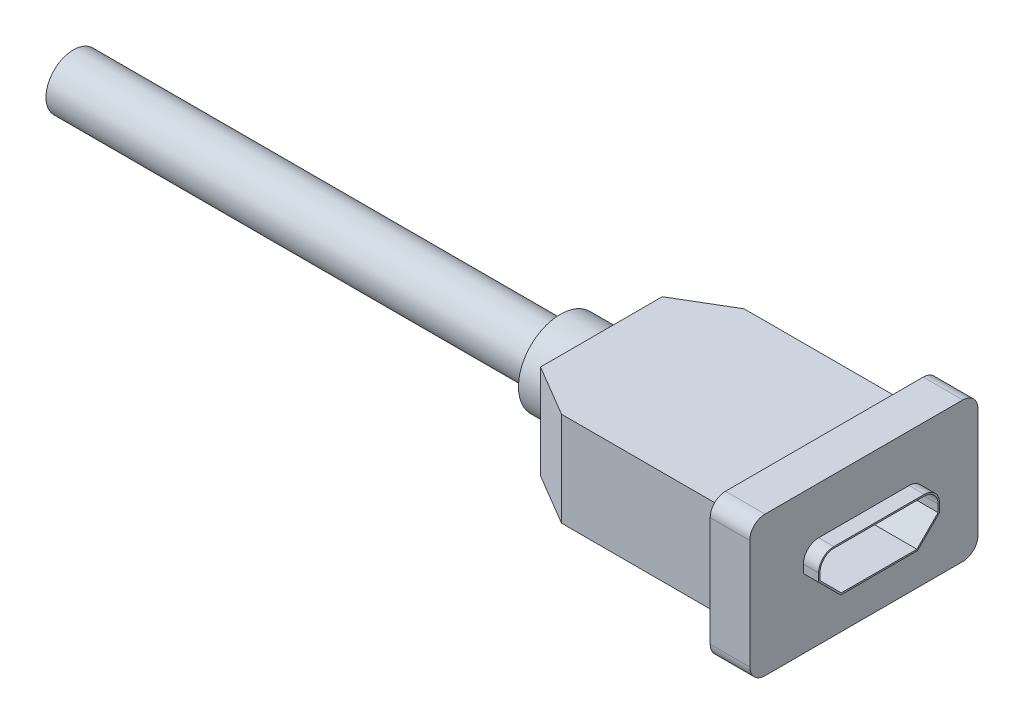
ISO-10303-21;
HEADER;
FILE_DESCRIPTION(('STEP AP214'),'2;1');
FILE_NAME('part.step','',(''),(''),'','','');
FILE_SCHEMA(('AUTOMOTIVE_DESIGN { 1 0 10303 214 1 1 1 1 }'));
ENDSEC;
DATA;
#1=APPLICATION_CONTEXT('core data for automotive mechanical design processes');
#2=APPLICATION_PROTOCOL_DEFINITION('international standard','automotive_design',2000,#1);
#3=PRODUCT_CONTEXT('',#1,'mechanical');
#4=PRODUCT('Part','Part','',(#3));
#5=PRODUCT_RELATED_PRODUCT_CATEGORY('part','',(#4));
#6=PRODUCT_DEFINITION_FORMATION('','',#4);
#7=PRODUCT_DEFINITION_CONTEXT('part definition',#1,'design');
#8=PRODUCT_DEFINITION('design','',#6,#7);
#9=PRODUCT_DEFINITION_SHAPE('','',#8);
#10=(LENGTH_UNIT() NAMED_UNIT(*) SI_UNIT(.MILLI.,.METRE.));
#11=(NAMED_UNIT(*) PLANE_ANGLE_UNIT() SI_UNIT($,.RADIAN.));
#12=(NAMED_UNIT(*) SI_UNIT($,.STERADIAN.) SOLID_ANGLE_UNIT());
#13=UNCERTAINTY_MEASURE_WITH_UNIT(LENGTH_MEASURE(1.E-05),#10,'distance_accuracy_value','');
#14=(GEOMETRIC_REPRESENTATION_CONTEXT(3) GLOBAL_UNCERTAINTY_ASSIGNED_CONTEXT((#13)) GLOBAL_UNIT_ASSIGNED_CONTEXT((#10,
#11,#12)) REPRESENTATION_CONTEXT('',''));
#15=CARTESIAN_POINT('',(0.,0.,0.));
#16=DIRECTION('',(0.,0.,1.));
#17=DIRECTION('',(1.,0.,0.));
#18=AXIS2_PLACEMENT_3D('',#15,#16,#17);
#19=CARTESIAN_POINT('',(0.,3.1,-6.));
#20=DIRECTION('',(-1.,0.,0.));
#21=DIRECTION('',(0.,0.,1.));
#22=AXIS2_PLACEMENT_3D('',#19,#20,#21);
#23=PLANE('',#22);
#24=DIRECTION('',(0.,0.,1.));
#25=VECTOR('',#24,1.);
#26=CARTESIAN_POINT('',(0.,4.6,-7.5));
#27=LINE('',#26,#25);
#28=CARTESIAN_POINT('',(0.,4.6,-6.5));
#29=VERTEX_POINT('',#28);
#30=CARTESIAN_POINT('',(0.,4.6,6.5));
#31=VERTEX_POINT('',#30);
#32=EDGE_CURVE('E381',#29,#31,#27,.T.);
#33=ORIENTED_EDGE('',*,*,#32,.T.);
#34=CARTESIAN_POINT('',(0.,3.6,6.5));
#35=DIRECTION('',(-1.,0.,0.));
#36=DIRECTION('',(0.,0.,1.));
#37=AXIS2_PLACEMENT_3D('',#34,#35,#36);
#38=CIRCLE('',#37,1.);
#39=CARTESIAN_POINT('',(0.,3.6,7.5));
#40=VERTEX_POINT('',#39);
#41=EDGE_CURVE('E452',#31,#40,#38,.F.);
#42=ORIENTED_EDGE('',*,*,#41,.T.);
#43=DIRECTION('',(0.,-1.,0.));
#44=VECTOR('',#43,1.);
#45=CARTESIAN_POINT('',(0.,4.6,7.5));
#46=LINE('',#45,#44);
#47=CARTESIAN_POINT('',(0.,-3.6,7.5));
#48=VERTEX_POINT('',#47);
#49=EDGE_CURVE('E373',#40,#48,#46,.T.);
#50=ORIENTED_EDGE('',*,*,#49,.T.);
#51=CARTESIAN_POINT('',(0.,-3.6,6.5));
#52=DIRECTION('',(-1.,0.,0.));
#53=DIRECTION('',(0.,0.,1.));
#54=AXIS2_PLACEMENT_3D('',#51,#52,#53);
#55=CIRCLE('',#54,1.);
#56=CARTESIAN_POINT('',(0.,-4.6,6.5));
#57=VERTEX_POINT('',#56);
#58=EDGE_CURVE('E450',#48,#57,#55,.F.);
#59=ORIENTED_EDGE('',*,*,#58,.T.);
#60=DIRECTION('',(0.,0.,-1.));
#61=VECTOR('',#60,1.);
#62=CARTESIAN_POINT('',(0.,-4.6,7.5));
#63=LINE('',#62,#61);
#64=CARTESIAN_POINT('',(0.,-4.6,-6.5));
#65=VERTEX_POINT('',#64);
#66=EDGE_CURVE('E393',#57,#65,#63,.T.);
#67=ORIENTED_EDGE('',*,*,#66,.T.);
#68=CARTESIAN_POINT('',(0.,-3.6,-6.5));
#69=DIRECTION('',(-1.,0.,0.));
#70=DIRECTION('',(0.,0.,1.));
#71=AXIS2_PLACEMENT_3D('',#68,#69,#70);
#72=CIRCLE('',#71,1.);
#73=CARTESIAN_POINT('',(0.,-3.6,-7.5));
#74=VERTEX_POINT('',#73);
#75=EDGE_CURVE('E448',#65,#74,#72,.F.);
#76=ORIENTED_EDGE('',*,*,#75,.T.);
#77=DIRECTION('',(0.,1.,0.));
#78=VECTOR('',#77,1.);
#79=CARTESIAN_POINT('',(0.,-4.6,-7.5));
#80=LINE('',#79,#78);
#81=CARTESIAN_POINT('',(0.,3.6,-7.5));
#82=VERTEX_POINT('',#81);
#83=EDGE_CURVE('E396',#74,#82,#80,.T.);
#84=ORIENTED_EDGE('',*,*,#83,.T.);
#85=CARTESIAN_POINT('',(0.,3.6,-6.5));
#86=DIRECTION('',(-1.,0.,0.));
#87=DIRECTION('',(0.,0.,1.));
#88=AXIS2_PLACEMENT_3D('',#85,#86,#87);
#89=CIRCLE('',#88,1.);
#90=EDGE_CURVE('E446',#82,#29,#89,.F.);
#91=ORIENTED_EDGE('',*,*,#90,.T.);
#92=EDGE_LOOP('',(#33,#42,#50,#59,#67,#76,#84,#91));
#93=FACE_BOUND('',#92,.T.);
#94=CARTESIAN_POINT('',(0.,0.489999999999999,-2.975));
#95=DIRECTION('',(1.,0.,0.));
#96=DIRECTION('',(0.,0.,-1.));
#97=AXIS2_PLACEMENT_3D('',#94,#95,#96);
#98=CIRCLE('',#97,1.);
#99=CARTESIAN_POINT('',(0.,0.49,-3.975));
#100=VERTEX_POINT('',#99);
#101=CARTESIAN_POINT('',(0.,1.49,-2.975));
#102=VERTEX_POINT('',#101);
#103=EDGE_CURVE('E270',#100,#102,#98,.T.);
#104=ORIENTED_EDGE('',*,*,#103,.F.);
#105=DIRECTION('',(0.,1.,0.));
#106=VECTOR('',#105,1.);
#107=CARTESIAN_POINT('',(0.,-0.0414213562373096,-3.975));
#108=LINE('',#107,#106);
#109=CARTESIAN_POINT('',(0.,-0.0414213562373094,-3.975));
#110=VERTEX_POINT('',#109);
#111=EDGE_CURVE('E275',#110,#100,#108,.T.);
#112=ORIENTED_EDGE('',*,*,#111,.F.);
#113=DIRECTION('',(0.,0.707106781186551,-0.707106781186544));
#114=VECTOR('',#113,1.);
#115=CARTESIAN_POINT('',(0.,-1.49,-2.52642135623732));
#116=LINE('',#115,#114);
#117=CARTESIAN_POINT('',(0.,-1.49,-2.52642135623733));
#118=VERTEX_POINT('',#117);
#119=EDGE_CURVE('E303',#118,#110,#116,.T.);
#120=ORIENTED_EDGE('',*,*,#119,.F.);
#121=DIRECTION('',(0.,0.,-1.));
#122=VECTOR('',#121,1.);
#123=CARTESIAN_POINT('',(0.,-1.49,2.52642135623732));
#124=LINE('',#123,#122);
#125=CARTESIAN_POINT('',(0.,-1.49,2.52642135623732));
#126=VERTEX_POINT('',#125);
#127=EDGE_CURVE('E300',#126,#118,#124,.T.);
#128=ORIENTED_EDGE('',*,*,#127,.F.);
#129=DIRECTION('',(0.,-0.707106781186551,-0.707106781186544));
#130=VECTOR('',#129,1.);
#131=CARTESIAN_POINT('',(0.,-0.0414213562373089,3.975));
#132=LINE('',#131,#130);
#133=CARTESIAN_POINT('',(0.,-0.0414213562373099,3.975));
#134=VERTEX_POINT('',#133);
#135=EDGE_CURVE('E297',#134,#126,#132,.T.);
#136=ORIENTED_EDGE('',*,*,#135,.F.);
#137=DIRECTION('',(0.,-1.,0.));
#138=VECTOR('',#137,1.);
#139=CARTESIAN_POINT('',(0.,0.49,3.975));
#140=LINE('',#139,#138);
#141=CARTESIAN_POINT('',(0.,0.49,3.975));
#142=VERTEX_POINT('',#141);
#143=EDGE_CURVE('E294',#142,#134,#140,.T.);
#144=ORIENTED_EDGE('',*,*,#143,.F.);
#145=CARTESIAN_POINT('',(0.,0.489999999999999,2.975));
#146=DIRECTION('',(1.,0.,0.));
#147=DIRECTION('',(0.,0.,-1.));
#148=AXIS2_PLACEMENT_3D('',#145,#146,#147);
#149=CIRCLE('',#148,1.);
#150=CARTESIAN_POINT('',(0.,1.49,2.975));
#151=VERTEX_POINT('',#150);
#152=EDGE_CURVE('E53',#151,#142,#149,.T.);
#153=ORIENTED_EDGE('',*,*,#152,.F.);
#154=DIRECTION('',(0.,0.,1.));
#155=VECTOR('',#154,1.);
#156=CARTESIAN_POINT('',(0.,1.49,-2.975));
#157=LINE('',#156,#155);
#158=EDGE_CURVE('E48',#102,#151,#157,.T.);
#159=ORIENTED_EDGE('',*,*,#158,.F.);
#160=EDGE_LOOP('',(#104,#112,#120,#128,#136,#144,#153,#159));
#161=FACE_BOUND('',#160,.T.);
#162=ADVANCED_FACE('F33',(#93,#161),#23,.F.);
#163=CARTESIAN_POINT('',(-13.87,3.1,-6.));
#164=DIRECTION('',(0.,0.,1.));
#165=DIRECTION('',(1.,0.,0.));
#166=AXIS2_PLACEMENT_3D('',#163,#164,#165);
#167=PLANE('',#166);
#168=DIRECTION('',(0.,1.,0.));
#169=VECTOR('',#168,1.);
#170=CARTESIAN_POINT('',(-2.6,3.1,-6.));
#171=LINE('',#170,#169);
#172=CARTESIAN_POINT('',(-2.6,-3.1,-6.));
#173=VERTEX_POINT('',#172);
#174=CARTESIAN_POINT('',(-2.6,3.1,-6.));
#175=VERTEX_POINT('',#174);
#176=EDGE_CURVE('E402',#173,#175,#171,.T.);
#177=ORIENTED_EDGE('',*,*,#176,.F.);
#178=DIRECTION('',(-1.,0.,0.));
#179=VECTOR('',#178,1.);
#180=CARTESIAN_POINT('',(-13.87,-3.1,-6.));
#181=LINE('',#180,#179);
#182=CARTESIAN_POINT('',(-13.87,-3.1,-6.));
#183=VERTEX_POINT('',#182);
#184=EDGE_CURVE('E406',#173,#183,#181,.T.);
#185=ORIENTED_EDGE('',*,*,#184,.T.);
#186=DIRECTION('',(0.,-1.,0.));
#187=VECTOR('',#186,1.);
#188=CARTESIAN_POINT('',(-13.87,3.1,-6.));
#189=LINE('',#188,#187);
#190=CARTESIAN_POINT('',(-13.87,3.1,-6.));
#191=VERTEX_POINT('',#190);
#192=EDGE_CURVE('E437',#191,#183,#189,.T.);
#193=ORIENTED_EDGE('',*,*,#192,.F.);
#194=DIRECTION('',(-1.,0.,0.));
#195=VECTOR('',#194,1.);
#196=CARTESIAN_POINT('',(-13.87,3.1,-6.));
#197=LINE('',#196,#195);
#198=EDGE_CURVE('E407',#175,#191,#197,.T.);
#199=ORIENTED_EDGE('',*,*,#198,.F.);
#200=EDGE_LOOP('',(#177,#185,#193,#199));
#201=FACE_BOUND('',#200,.T.);
#202=ADVANCED_FACE('F520',(#201),#167,.F.);
#203=CARTESIAN_POINT('',(0.,3.1,6.));
#204=DIRECTION('',(0.,0.,-1.));
#205=DIRECTION('',(-1.,0.,0.));
#206=AXIS2_PLACEMENT_3D('',#203,#204,#205);
#207=PLANE('',#206);
#208=DIRECTION('',(0.,-1.,0.));
#209=VECTOR('',#208,1.);
#210=CARTESIAN_POINT('',(-2.6,3.1,6.));
#211=LINE('',#210,#209);
#212=CARTESIAN_POINT('',(-2.6,3.1,6.));
#213=VERTEX_POINT('',#212);
#214=CARTESIAN_POINT('',(-2.6,-3.1,6.));
#215=VERTEX_POINT('',#214);
#216=EDGE_CURVE('E390',#213,#215,#211,.T.);
#217=ORIENTED_EDGE('',*,*,#216,.F.);
#218=DIRECTION('',(1.,0.,0.));
#219=VECTOR('',#218,1.);
#220=CARTESIAN_POINT('',(0.,3.1,6.));
#221=LINE('',#220,#219);
#222=CARTESIAN_POINT('',(-13.87,3.1,6.));
#223=VERTEX_POINT('',#222);
#224=EDGE_CURVE('E416',#223,#213,#221,.T.);
#225=ORIENTED_EDGE('',*,*,#224,.F.);
#226=DIRECTION('',(0.,-1.,0.));
#227=VECTOR('',#226,1.);
#228=CARTESIAN_POINT('',(-13.87,3.1,6.));
#229=LINE('',#228,#227);
#230=CARTESIAN_POINT('',(-13.87,-3.1,6.));
#231=VERTEX_POINT('',#230);
#232=EDGE_CURVE('E419',#223,#231,#229,.T.);
#233=ORIENTED_EDGE('',*,*,#232,.T.);
#234=DIRECTION('',(1.,0.,0.));
#235=VECTOR('',#234,1.);
#236=CARTESIAN_POINT('',(0.,-3.1,6.));
#237=LINE('',#236,#235);
#238=EDGE_CURVE('E410',#231,#215,#237,.T.);
#239=ORIENTED_EDGE('',*,*,#238,.T.);
#240=EDGE_LOOP('',(#217,#225,#233,#239));
#241=FACE_BOUND('',#240,.T.);
#242=ADVANCED_FACE('F525',(#241),#207,.F.);
#243=CARTESIAN_POINT('',(0.,3.1,0.));
#244=DIRECTION('',(0.,-1.,0.));
#245=DIRECTION('',(0.,0.,-1.));
#246=AXIS2_PLACEMENT_3D('',#243,#244,#245);
#247=PLANE('',#246);
#248=DIRECTION('',(0.,0.,1.));
#249=VECTOR('',#248,1.);
#250=CARTESIAN_POINT('',(-2.6,3.1,0.));
#251=LINE('',#250,#249);
#252=EDGE_CURVE('E404',#175,#213,#251,.T.);
#253=ORIENTED_EDGE('',*,*,#252,.F.);
#254=ORIENTED_EDGE('',*,*,#198,.T.);
#255=DIRECTION('',(-0.860622231738049,0.,0.509243924105354));
#256=VECTOR('',#255,1.);
#257=CARTESIAN_POINT('',(-17.25,3.1,-4.));
#258=LINE('',#257,#256);
#259=CARTESIAN_POINT('',(-17.25,3.1,-4.));
#260=VERTEX_POINT('',#259);
#261=EDGE_CURVE('E409',#191,#260,#258,.T.);
#262=ORIENTED_EDGE('',*,*,#261,.T.);
#263=DIRECTION('',(0.,0.,1.));
#264=VECTOR('',#263,1.);
#265=CARTESIAN_POINT('',(-17.25,3.1,4.));
#266=LINE('',#265,#264);
#267=CARTESIAN_POINT('',(-17.25,3.1,4.));
#268=VERTEX_POINT('',#267);
#269=EDGE_CURVE('E412',#260,#268,#266,.T.);
#270=ORIENTED_EDGE('',*,*,#269,.T.);
#271=DIRECTION('',(0.860622231738049,0.,0.509243924105354));
#272=VECTOR('',#271,1.);
#273=CARTESIAN_POINT('',(-13.87,3.1,6.));
#274=LINE('',#273,#272);
#275=EDGE_CURVE('E414',#268,#223,#274,.T.);
#276=ORIENTED_EDGE('',*,*,#275,.T.);
#277=ORIENTED_EDGE('',*,*,#224,.T.);
#278=EDGE_LOOP('',(#253,#254,#262,#270,#276,#277));
#279=FACE_BOUND('',#278,.T.);
#280=ADVANCED_FACE('F534',(#279),#247,.F.);
#281=CARTESIAN_POINT('',(0.,-3.1,0.));
#282=DIRECTION('',(0.,-1.,0.));
#283=DIRECTION('',(0.,0.,-1.));
#284=AXIS2_PLACEMENT_3D('',#281,#282,#283);
#285=PLANE('',#284);
#286=ORIENTED_EDGE('',*,*,#184,.F.);
#287=DIRECTION('',(0.,0.,1.));
#288=VECTOR('',#287,1.);
#289=CARTESIAN_POINT('',(-2.6,-3.1,0.));
#290=LINE('',#289,#288);
#291=EDGE_CURVE('E376',#173,#215,#290,.T.);
#292=ORIENTED_EDGE('',*,*,#291,.T.);
#293=ORIENTED_EDGE('',*,*,#238,.F.);
#294=DIRECTION('',(0.860622231738049,0.,0.509243924105354));
#295=VECTOR('',#294,1.);
#296=CARTESIAN_POINT('',(-13.87,-3.1,6.));
#297=LINE('',#296,#295);
#298=CARTESIAN_POINT('',(-17.25,-3.1,4.));
#299=VERTEX_POINT('',#298);
#300=EDGE_CURVE('E425',#299,#231,#297,.T.);
#301=ORIENTED_EDGE('',*,*,#300,.F.);
#302=DIRECTION('',(0.,0.,1.));
#303=VECTOR('',#302,1.);
#304=CARTESIAN_POINT('',(-17.25,-3.1,4.));
#305=LINE('',#304,#303);
#306=CARTESIAN_POINT('',(-17.25,-3.1,-4.));
#307=VERTEX_POINT('',#306);
#308=EDGE_CURVE('E423',#307,#299,#305,.T.);
#309=ORIENTED_EDGE('',*,*,#308,.F.);
#310=DIRECTION('',(-0.860622231738049,0.,0.509243924105354));
#311=VECTOR('',#310,1.);
#312=CARTESIAN_POINT('',(-17.25,-3.1,-4.));
#313=LINE('',#312,#311);
#314=EDGE_CURVE('E421',#183,#307,#313,.T.);
#315=ORIENTED_EDGE('',*,*,#314,.F.);
#316=EDGE_LOOP('',(#286,#292,#293,#301,#309,#315));
#317=FACE_BOUND('',#316,.T.);
#318=ADVANCED_FACE('F530',(#317),#285,.T.);
#319=CARTESIAN_POINT('',(-17.25,3.1,-4.));
#320=DIRECTION('',(0.509243924105354,0.,0.860622231738049));
#321=DIRECTION('',(0.860622231738049,0.,-0.509243924105354));
#322=AXIS2_PLACEMENT_3D('',#319,#320,#321);
#323=PLANE('',#322);
#324=ORIENTED_EDGE('',*,*,#314,.T.);
#325=DIRECTION('',(0.,-1.,0.));
#326=VECTOR('',#325,1.);
#327=CARTESIAN_POINT('',(-17.25,3.1,-4.));
#328=LINE('',#327,#326);
#329=EDGE_CURVE('E434',#260,#307,#328,.T.);
#330=ORIENTED_EDGE('',*,*,#329,.F.);
#331=ORIENTED_EDGE('',*,*,#261,.F.);
#332=ORIENTED_EDGE('',*,*,#192,.T.);
#333=EDGE_LOOP('',(#324,#330,#331,#332));
#334=FACE_BOUND('',#333,.T.);
#335=ADVANCED_FACE('F543',(#334),#323,.F.);
#336=CARTESIAN_POINT('',(-17.25,3.1,4.));
#337=DIRECTION('',(1.,0.,0.));
#338=DIRECTION('',(0.,0.,-1.));
#339=AXIS2_PLACEMENT_3D('',#336,#337,#338);
#340=PLANE('',#339);
#341=CARTESIAN_POINT('',(-17.25,0.,0.));
#342=DIRECTION('',(-1.,0.,0.));
#343=DIRECTION('',(0.,0.,1.));
#344=AXIS2_PLACEMENT_3D('',#341,#342,#343);
#345=CIRCLE('',#344,2.75);
#346=CARTESIAN_POINT('',(-17.25,0.,2.75));
#347=VERTEX_POINT('',#346);
#348=EDGE_CURVE('E370',#347,#347,#345,.T.);
#349=ORIENTED_EDGE('',*,*,#348,.F.);
#350=EDGE_LOOP('',(#349));
#351=FACE_BOUND('',#350,.T.);
#352=ORIENTED_EDGE('',*,*,#308,.T.);
#353=DIRECTION('',(0.,-1.,0.));
#354=VECTOR('',#353,1.);
#355=CARTESIAN_POINT('',(-17.25,3.1,4.));
#356=LINE('',#355,#354);
#357=EDGE_CURVE('E431',#268,#299,#356,.T.);
#358=ORIENTED_EDGE('',*,*,#357,.F.);
#359=ORIENTED_EDGE('',*,*,#269,.F.);
#360=ORIENTED_EDGE('',*,*,#329,.T.);
#361=EDGE_LOOP('',(#352,#358,#359,#360));
#362=FACE_BOUND('',#361,.T.);
#363=ADVANCED_FACE('F539',(#351,#362),#340,.F.);
#364=CARTESIAN_POINT('',(-13.87,3.1,6.));
#365=DIRECTION('',(0.509243924105354,0.,-0.860622231738049));
#366=DIRECTION('',(-0.860622231738049,0.,-0.509243924105354));
#367=AXIS2_PLACEMENT_3D('',#364,#365,#366);
#368=PLANE('',#367);
#369=ORIENTED_EDGE('',*,*,#300,.T.);
#370=ORIENTED_EDGE('',*,*,#232,.F.);
#371=ORIENTED_EDGE('',*,*,#275,.F.);
#372=ORIENTED_EDGE('',*,*,#357,.T.);
#373=EDGE_LOOP('',(#369,#370,#371,#372));
#374=FACE_BOUND('',#373,.T.);
#375=ADVANCED_FACE('F536',(#374),#368,.F.);
#376=CARTESIAN_POINT('',(-2.6,0.,0.));
#377=DIRECTION('',(1.,0.,0.));
#378=DIRECTION('',(0.,0.,-1.));
#379=AXIS2_PLACEMENT_3D('',#376,#377,#378);
#380=PLANE('',#379);
#381=DIRECTION('',(0.,-1.,0.));
#382=VECTOR('',#381,1.);
#383=CARTESIAN_POINT('',(-2.6,4.6,7.5));
#384=LINE('',#383,#382);
#385=CARTESIAN_POINT('',(-2.6,3.6,7.5));
#386=VERTEX_POINT('',#385);
#387=CARTESIAN_POINT('',(-2.6,-3.6,7.5));
#388=VERTEX_POINT('',#387);
#389=EDGE_CURVE('E377',#386,#388,#384,.T.);
#390=ORIENTED_EDGE('',*,*,#389,.F.);
#391=CARTESIAN_POINT('',(-2.6,3.6,6.5));
#392=DIRECTION('',(1.,0.,0.));
#393=DIRECTION('',(0.,0.,-1.));
#394=AXIS2_PLACEMENT_3D('',#391,#392,#393);
#395=CIRCLE('',#394,1.);
#396=CARTESIAN_POINT('',(-2.6,4.6,6.5));
#397=VERTEX_POINT('',#396);
#398=EDGE_CURVE('E465',#386,#397,#395,.F.);
#399=ORIENTED_EDGE('',*,*,#398,.T.);
#400=DIRECTION('',(0.,0.,1.));
#401=VECTOR('',#400,1.);
#402=CARTESIAN_POINT('',(-2.6,4.6,-7.5));
#403=LINE('',#402,#401);
#404=CARTESIAN_POINT('',(-2.6,4.6,-6.5));
#405=VERTEX_POINT('',#404);
#406=EDGE_CURVE('E387',#405,#397,#403,.T.);
#407=ORIENTED_EDGE('',*,*,#406,.F.);
#408=CARTESIAN_POINT('',(-2.6,3.6,-6.5));
#409=DIRECTION('',(1.,0.,0.));
#410=DIRECTION('',(0.,0.,-1.));
#411=AXIS2_PLACEMENT_3D('',#408,#409,#410);
#412=CIRCLE('',#411,1.);
#413=CARTESIAN_POINT('',(-2.6,3.6,-7.5));
#414=VERTEX_POINT('',#413);
#415=EDGE_CURVE('E459',#405,#414,#412,.F.);
#416=ORIENTED_EDGE('',*,*,#415,.T.);
#417=DIRECTION('',(0.,1.,0.));
#418=VECTOR('',#417,1.);
#419=CARTESIAN_POINT('',(-2.6,-4.6,-7.5));
#420=LINE('',#419,#418);
#421=CARTESIAN_POINT('',(-2.6,-3.6,-7.5));
#422=VERTEX_POINT('',#421);
#423=EDGE_CURVE('E384',#422,#414,#420,.T.);
#424=ORIENTED_EDGE('',*,*,#423,.F.);
#425=CARTESIAN_POINT('',(-2.6,-3.6,-6.5));
#426=DIRECTION('',(1.,0.,0.));
#427=DIRECTION('',(0.,0.,-1.));
#428=AXIS2_PLACEMENT_3D('',#425,#426,#427);
#429=CIRCLE('',#428,1.);
#430=CARTESIAN_POINT('',(-2.6,-4.6,-6.5));
#431=VERTEX_POINT('',#430);
#432=EDGE_CURVE('E461',#422,#431,#429,.F.);
#433=ORIENTED_EDGE('',*,*,#432,.T.);
#434=DIRECTION('',(0.,0.,-1.));
#435=VECTOR('',#434,1.);
#436=CARTESIAN_POINT('',(-2.6,-4.6,7.5));
#437=LINE('',#436,#435);
#438=CARTESIAN_POINT('',(-2.6,-4.6,6.5));
#439=VERTEX_POINT('',#438);
#440=EDGE_CURVE('E380',#439,#431,#437,.T.);
#441=ORIENTED_EDGE('',*,*,#440,.F.);
#442=CARTESIAN_POINT('',(-2.6,-3.6,6.5));
#443=DIRECTION('',(1.,0.,0.));
#444=DIRECTION('',(0.,0.,-1.));
#445=AXIS2_PLACEMENT_3D('',#442,#443,#444);
#446=CIRCLE('',#445,1.);
#447=EDGE_CURVE('E463',#439,#388,#446,.F.);
#448=ORIENTED_EDGE('',*,*,#447,.T.);
#449=EDGE_LOOP('',(#390,#399,#407,#416,#424,#433,#441,#448));
#450=FACE_BOUND('',#449,.T.);
#451=ORIENTED_EDGE('',*,*,#176,.T.);
#452=ORIENTED_EDGE('',*,*,#252,.T.);
#453=ORIENTED_EDGE('',*,*,#216,.T.);
#454=ORIENTED_EDGE('',*,*,#291,.F.);
#455=EDGE_LOOP('',(#451,#452,#453,#454));
#456=FACE_BOUND('',#455,.T.);
#457=ADVANCED_FACE('F494',(#450,#456),#380,.F.);
#458=CARTESIAN_POINT('',(-2.6,4.6,7.5));
#459=DIRECTION('',(0.,0.,1.));
#460=DIRECTION('',(1.,0.,0.));
#461=AXIS2_PLACEMENT_3D('',#458,#459,#460);
#462=PLANE('',#461);
#463=ORIENTED_EDGE('',*,*,#49,.F.);
#464=DIRECTION('',(1.,0.,0.));
#465=VECTOR('',#464,1.);
#466=CARTESIAN_POINT('',(-2.6,3.6,7.5));
#467=LINE('',#466,#465);
#468=EDGE_CURVE('E457',#40,#386,#467,.F.);
#469=ORIENTED_EDGE('',*,*,#468,.T.);
#470=ORIENTED_EDGE('',*,*,#389,.T.);
#471=DIRECTION('',(1.,0.,0.));
#472=VECTOR('',#471,1.);
#473=CARTESIAN_POINT('',(-2.6,-3.6,7.5));
#474=LINE('',#473,#472);
#475=EDGE_CURVE('E454',#388,#48,#474,.T.);
#476=ORIENTED_EDGE('',*,*,#475,.T.);
#477=EDGE_LOOP('',(#463,#469,#470,#476));
#478=FACE_BOUND('',#477,.T.);
#479=ADVANCED_FACE('F501',(#478),#462,.T.);
#480=CARTESIAN_POINT('',(-2.6,4.6,-7.5));
#481=DIRECTION('',(0.,1.,0.));
#482=DIRECTION('',(0.,0.,1.));
#483=AXIS2_PLACEMENT_3D('',#480,#481,#482);
#484=PLANE('',#483);
#485=ORIENTED_EDGE('',*,*,#406,.T.);
#486=DIRECTION('',(1.,0.,0.));
#487=VECTOR('',#486,1.);
#488=CARTESIAN_POINT('',(-2.6,4.6,6.5));
#489=LINE('',#488,#487);
#490=EDGE_CURVE('E443',#397,#31,#489,.T.);
#491=ORIENTED_EDGE('',*,*,#490,.T.);
#492=ORIENTED_EDGE('',*,*,#32,.F.);
#493=DIRECTION('',(1.,0.,0.));
#494=VECTOR('',#493,1.);
#495=CARTESIAN_POINT('',(-2.6,4.6,-6.5));
#496=LINE('',#495,#494);
#497=EDGE_CURVE('E369',#29,#405,#496,.F.);
#498=ORIENTED_EDGE('',*,*,#497,.T.);
#499=EDGE_LOOP('',(#485,#491,#492,#498));
#500=FACE_BOUND('',#499,.T.);
#501=ADVANCED_FACE('F508',(#500),#484,.T.);
#502=CARTESIAN_POINT('',(-2.6,-4.6,-7.5));
#503=DIRECTION('',(0.,0.,-1.));
#504=DIRECTION('',(-1.,0.,0.));
#505=AXIS2_PLACEMENT_3D('',#502,#503,#504);
#506=PLANE('',#505);
#507=ORIENTED_EDGE('',*,*,#83,.F.);
#508=DIRECTION('',(1.,0.,0.));
#509=VECTOR('',#508,1.);
#510=CARTESIAN_POINT('',(-2.6,-3.6,-7.5));
#511=LINE('',#510,#509);
#512=EDGE_CURVE('E11',#74,#422,#511,.F.);
#513=ORIENTED_EDGE('',*,*,#512,.T.);
#514=ORIENTED_EDGE('',*,*,#423,.T.);
#515=DIRECTION('',(1.,0.,0.));
#516=VECTOR('',#515,1.);
#517=CARTESIAN_POINT('',(-2.6,3.6,-7.5));
#518=LINE('',#517,#516);
#519=EDGE_CURVE('E41',#414,#82,#518,.T.);
#520=ORIENTED_EDGE('',*,*,#519,.T.);
#521=EDGE_LOOP('',(#507,#513,#514,#520));
#522=FACE_BOUND('',#521,.T.);
#523=ADVANCED_FACE('F475',(#522),#506,.T.);
#524=CARTESIAN_POINT('',(-2.6,-4.6,7.5));
#525=DIRECTION('',(0.,-1.,0.));
#526=DIRECTION('',(0.,0.,-1.));
#527=AXIS2_PLACEMENT_3D('',#524,#525,#526);
#528=PLANE('',#527);
#529=ORIENTED_EDGE('',*,*,#66,.F.);
#530=DIRECTION('',(1.,0.,0.));
#531=VECTOR('',#530,1.);
#532=CARTESIAN_POINT('',(-2.6,-4.6,6.5));
#533=LINE('',#532,#531);
#534=EDGE_CURVE('E470',#57,#439,#533,.F.);
#535=ORIENTED_EDGE('',*,*,#534,.T.);
#536=ORIENTED_EDGE('',*,*,#440,.T.);
#537=DIRECTION('',(1.,0.,0.));
#538=VECTOR('',#537,1.);
#539=CARTESIAN_POINT('',(-2.6,-4.6,-6.5));
#540=LINE('',#539,#538);
#541=EDGE_CURVE('E467',#431,#65,#540,.T.);
#542=ORIENTED_EDGE('',*,*,#541,.T.);
#543=EDGE_LOOP('',(#529,#535,#536,#542));
#544=FACE_BOUND('',#543,.T.);
#545=ADVANCED_FACE('F488',(#544),#528,.T.);
#546=CARTESIAN_POINT('',(-19.95,0.,0.));
#547=DIRECTION('',(1.,0.,0.));
#548=DIRECTION('',(0.,0.,-1.));
#549=AXIS2_PLACEMENT_3D('',#546,#547,#548);
#550=CYLINDRICAL_SURFACE('',#549,2.75);
#551=CARTESIAN_POINT('',(-19.95,0.,0.));
#552=DIRECTION('',(-1.,0.,0.));
#553=DIRECTION('',(0.,0.,1.));
#554=AXIS2_PLACEMENT_3D('',#551,#552,#553);
#555=CIRCLE('',#554,2.75);
#556=CARTESIAN_POINT('',(-19.95,0.,2.75));
#557=VERTEX_POINT('',#556);
#558=EDGE_CURVE('E365',#557,#557,#555,.T.);
#559=ORIENTED_EDGE('',*,*,#558,.F.);
#560=EDGE_LOOP('',(#559));
#561=FACE_BOUND('',#560,.T.);
#562=ORIENTED_EDGE('',*,*,#348,.T.);
#563=EDGE_LOOP('',(#562));
#564=FACE_BOUND('',#563,.T.);
#565=ADVANCED_FACE('F779',(#561,#564),#550,.T.);
#566=CARTESIAN_POINT('',(-19.95,0.,0.));
#567=DIRECTION('',(-1.,0.,0.));
#568=DIRECTION('',(0.,0.,1.));
#569=AXIS2_PLACEMENT_3D('',#566,#567,#568);
#570=PLANE('',#569);
#571=CARTESIAN_POINT('',(-19.95,0.,0.));
#572=DIRECTION('',(-1.,0.,0.));
#573=DIRECTION('',(0.,0.,1.));
#574=AXIS2_PLACEMENT_3D('',#571,#572,#573);
#575=CIRCLE('',#574,1.8);
#576=CARTESIAN_POINT('',(-19.95,0.,1.8));
#577=VERTEX_POINT('',#576);
#578=EDGE_CURVE('E366',#577,#577,#575,.T.);
#579=ORIENTED_EDGE('',*,*,#578,.F.);
#580=EDGE_LOOP('',(#579));
#581=FACE_BOUND('',#580,.T.);
#582=ORIENTED_EDGE('',*,*,#558,.T.);
#583=EDGE_LOOP('',(#582));
#584=FACE_BOUND('',#583,.T.);
#585=ADVANCED_FACE('F775',(#581,#584),#570,.T.);
#586=CARTESIAN_POINT('',(-51.95,0.,0.));
#587=DIRECTION('',(1.,0.,0.));
#588=DIRECTION('',(0.,0.,-1.));
#589=AXIS2_PLACEMENT_3D('',#586,#587,#588);
#590=CYLINDRICAL_SURFACE('',#589,1.8);
#591=CARTESIAN_POINT('',(-51.95,0.,0.));
#592=DIRECTION('',(-1.,0.,0.));
#593=DIRECTION('',(0.,0.,1.));
#594=AXIS2_PLACEMENT_3D('',#591,#592,#593);
#595=CIRCLE('',#594,1.8);
#596=CARTESIAN_POINT('',(-51.95,0.,1.8));
#597=VERTEX_POINT('',#596);
#598=EDGE_CURVE('E351',#597,#597,#595,.T.);
#599=ORIENTED_EDGE('',*,*,#598,.F.);
#600=EDGE_LOOP('',(#599));
#601=FACE_BOUND('',#600,.T.);
#602=ORIENTED_EDGE('',*,*,#578,.T.);
#603=EDGE_LOOP('',(#602));
#604=FACE_BOUND('',#603,.T.);
#605=ADVANCED_FACE('F771',(#601,#604),#590,.T.);
#606=CARTESIAN_POINT('',(-51.95,0.,0.));
#607=DIRECTION('',(-1.,0.,0.));
#608=DIRECTION('',(0.,0.,1.));
#609=AXIS2_PLACEMENT_3D('',#606,#607,#608);
#610=PLANE('',#609);
#611=ORIENTED_EDGE('',*,*,#598,.T.);
#612=EDGE_LOOP('',(#611));
#613=FACE_BOUND('',#612,.T.);
#614=ADVANCED_FACE('F550',(#613),#610,.T.);
#615=CARTESIAN_POINT('',(-2.6,3.6,6.5));
#616=DIRECTION('',(1.,0.,0.));
#617=DIRECTION('',(0.,0.,-1.));
#618=AXIS2_PLACEMENT_3D('',#615,#616,#617);
#619=CYLINDRICAL_SURFACE('',#618,1.);
#620=ORIENTED_EDGE('',*,*,#398,.F.);
#621=ORIENTED_EDGE('',*,*,#468,.F.);
#622=ORIENTED_EDGE('',*,*,#41,.F.);
#623=ORIENTED_EDGE('',*,*,#490,.F.);
#624=EDGE_LOOP('',(#620,#621,#622,#623));
#625=FACE_BOUND('',#624,.T.);
#626=ADVANCED_FACE('F506',(#625),#619,.T.);
#627=CARTESIAN_POINT('',(-2.6,-3.6,6.5));
#628=DIRECTION('',(1.,0.,0.));
#629=DIRECTION('',(0.,0.,-1.));
#630=AXIS2_PLACEMENT_3D('',#627,#628,#629);
#631=CYLINDRICAL_SURFACE('',#630,1.);
#632=ORIENTED_EDGE('',*,*,#447,.F.);
#633=ORIENTED_EDGE('',*,*,#534,.F.);
#634=ORIENTED_EDGE('',*,*,#58,.F.);
#635=ORIENTED_EDGE('',*,*,#475,.F.);
#636=EDGE_LOOP('',(#632,#633,#634,#635));
#637=FACE_BOUND('',#636,.T.);
#638=ADVANCED_FACE('F498',(#637),#631,.T.);
#639=CARTESIAN_POINT('',(-2.6,-3.6,-6.5));
#640=DIRECTION('',(1.,0.,0.));
#641=DIRECTION('',(0.,0.,-1.));
#642=AXIS2_PLACEMENT_3D('',#639,#640,#641);
#643=CYLINDRICAL_SURFACE('',#642,1.);
#644=ORIENTED_EDGE('',*,*,#432,.F.);
#645=ORIENTED_EDGE('',*,*,#512,.F.);
#646=ORIENTED_EDGE('',*,*,#75,.F.);
#647=ORIENTED_EDGE('',*,*,#541,.F.);
#648=EDGE_LOOP('',(#644,#645,#646,#647));
#649=FACE_BOUND('',#648,.T.);
#650=ADVANCED_FACE('F486',(#649),#643,.T.);
#651=CARTESIAN_POINT('',(-2.6,3.6,-6.5));
#652=DIRECTION('',(1.,0.,0.));
#653=DIRECTION('',(0.,0.,-1.));
#654=AXIS2_PLACEMENT_3D('',#651,#652,#653);
#655=CYLINDRICAL_SURFACE('',#654,1.);
#656=ORIENTED_EDGE('',*,*,#415,.F.);
#657=ORIENTED_EDGE('',*,*,#497,.F.);
#658=ORIENTED_EDGE('',*,*,#90,.F.);
#659=ORIENTED_EDGE('',*,*,#519,.F.);
#660=EDGE_LOOP('',(#656,#657,#658,#659));
#661=FACE_BOUND('',#660,.T.);
#662=ADVANCED_FACE('F35',(#661),#655,.T.);
#663=CARTESIAN_POINT('',(0.999999999999999,0.489999999999999,-2.975));
#664=DIRECTION('',(1.,0.,0.));
#665=DIRECTION('',(0.,0.,-1.));
#666=AXIS2_PLACEMENT_3D('',#663,#664,#665);
#667=PLANE('',#666);
#668=CARTESIAN_POINT('',(0.999999999999999,0.489999999999999,-2.975));
#669=DIRECTION('',(1.,0.,0.));
#670=DIRECTION('',(0.,0.,-1.));
#671=AXIS2_PLACEMENT_3D('',#668,#669,#670);
#672=CIRCLE('',#671,1.);
#673=CARTESIAN_POINT('',(0.999999999999999,0.49,-3.975));
#674=VERTEX_POINT('',#673);
#675=CARTESIAN_POINT('',(0.999999999999999,1.49,-2.975));
#676=VERTEX_POINT('',#675);
#677=EDGE_CURVE('E271',#674,#676,#672,.T.);
#678=ORIENTED_EDGE('',*,*,#677,.T.);
#679=DIRECTION('',(0.,0.,1.));
#680=VECTOR('',#679,1.);
#681=CARTESIAN_POINT('',(0.999999999999999,1.49,-2.975));
#682=LINE('',#681,#680);
#683=CARTESIAN_POINT('',(1.,1.49,2.975));
#684=VERTEX_POINT('',#683);
#685=EDGE_CURVE('E274',#676,#684,#682,.T.);
#686=ORIENTED_EDGE('',*,*,#685,.T.);
#687=CARTESIAN_POINT('',(1.,0.489999999999999,2.975));
#688=DIRECTION('',(1.,0.,0.));
#689=DIRECTION('',(0.,0.,-1.));
#690=AXIS2_PLACEMENT_3D('',#687,#688,#689);
#691=CIRCLE('',#690,1.);
#692=CARTESIAN_POINT('',(1.,0.49,3.975));
#693=VERTEX_POINT('',#692);
#694=EDGE_CURVE('E277',#684,#693,#691,.T.);
#695=ORIENTED_EDGE('',*,*,#694,.T.);
#696=DIRECTION('',(0.,-1.,0.));
#697=VECTOR('',#696,1.);
#698=CARTESIAN_POINT('',(1.,0.49,3.975));
#699=LINE('',#698,#697);
#700=CARTESIAN_POINT('',(1.,-0.0414213562373089,3.975));
#701=VERTEX_POINT('',#700);
#702=EDGE_CURVE('E279',#693,#701,#699,.T.);
#703=ORIENTED_EDGE('',*,*,#702,.T.);
#704=DIRECTION('',(0.,-0.707106781186551,-0.707106781186544));
#705=VECTOR('',#704,1.);
#706=CARTESIAN_POINT('',(1.,-0.0414213562373089,3.975));
#707=LINE('',#706,#705);
#708=CARTESIAN_POINT('',(1.,-1.49,2.52642135623732));
#709=VERTEX_POINT('',#708);
#710=EDGE_CURVE('E281',#701,#709,#707,.T.);
#711=ORIENTED_EDGE('',*,*,#710,.T.);
#712=DIRECTION('',(0.,0.,-1.));
#713=VECTOR('',#712,1.);
#714=CARTESIAN_POINT('',(1.,-1.49,2.52642135623732));
#715=LINE('',#714,#713);
#716=CARTESIAN_POINT('',(0.999999999999999,-1.49,-2.52642135623733));
#717=VERTEX_POINT('',#716);
#718=EDGE_CURVE('E283',#709,#717,#715,.T.);
#719=ORIENTED_EDGE('',*,*,#718,.T.);
#720=DIRECTION('',(0.,0.707106781186551,-0.707106781186544));
#721=VECTOR('',#720,1.);
#722=CARTESIAN_POINT('',(0.999999999999999,-1.49,-2.52642135623733));
#723=LINE('',#722,#721);
#724=CARTESIAN_POINT('',(0.999999999999999,-0.0414213562373096,-3.975));
#725=VERTEX_POINT('',#724);
#726=EDGE_CURVE('E285',#717,#725,#723,.T.);
#727=ORIENTED_EDGE('',*,*,#726,.T.);
#728=DIRECTION('',(0.,1.,0.));
#729=VECTOR('',#728,1.);
#730=CARTESIAN_POINT('',(0.999999999999999,-0.0414213562373096,-3.975));
#731=LINE('',#730,#729);
#732=EDGE_CURVE('E287',#725,#674,#731,.T.);
#733=ORIENTED_EDGE('',*,*,#732,.T.);
#734=EDGE_LOOP('',(#678,#686,#695,#703,#711,#719,#727,#733));
#735=FACE_BOUND('',#734,.T.);
#736=DIRECTION('',(0.,-1.,0.));
#737=VECTOR('',#736,1.);
#738=CARTESIAN_POINT('',(1.,0.49,3.875));
#739=LINE('',#738,#737);
#740=CARTESIAN_POINT('',(1.,0.49,3.875));
#741=VERTEX_POINT('',#740);
#742=CARTESIAN_POINT('',(1.,0.,3.875));
#743=VERTEX_POINT('',#742);
#744=EDGE_CURVE('E231',#741,#743,#739,.T.);
#745=ORIENTED_EDGE('',*,*,#744,.F.);
#746=CARTESIAN_POINT('',(1.,0.489999999999999,2.975));
#747=DIRECTION('',(1.,0.,0.));
#748=DIRECTION('',(0.,0.,-1.));
#749=AXIS2_PLACEMENT_3D('',#746,#747,#748);
#750=CIRCLE('',#749,0.9);
#751=CARTESIAN_POINT('',(1.,1.39,2.975));
#752=VERTEX_POINT('',#751);
#753=EDGE_CURVE('E242',#752,#741,#750,.T.);
#754=ORIENTED_EDGE('',*,*,#753,.F.);
#755=DIRECTION('',(0.,0.,1.));
#756=VECTOR('',#755,1.);
#757=CARTESIAN_POINT('',(0.999999999999999,1.39,-2.975));
#758=LINE('',#757,#756);
#759=CARTESIAN_POINT('',(0.999999999999999,1.39,-2.975));
#760=VERTEX_POINT('',#759);
#761=EDGE_CURVE('E268',#760,#752,#758,.T.);
#762=ORIENTED_EDGE('',*,*,#761,.F.);
#763=CARTESIAN_POINT('',(0.999999999999999,0.489999999999999,-2.975));
#764=DIRECTION('',(1.,0.,0.));
#765=DIRECTION('',(0.,0.,-1.));
#766=AXIS2_PLACEMENT_3D('',#763,#764,#765);
#767=CIRCLE('',#766,0.9);
#768=CARTESIAN_POINT('',(0.999999999999999,0.49,-3.875));
#769=VERTEX_POINT('',#768);
#770=EDGE_CURVE('E265',#769,#760,#767,.T.);
#771=ORIENTED_EDGE('',*,*,#770,.F.);
#772=DIRECTION('',(0.,1.,0.));
#773=VECTOR('',#772,1.);
#774=CARTESIAN_POINT('',(0.999999999999999,0.,-3.875));
#775=LINE('',#774,#773);
#776=CARTESIAN_POINT('',(0.999999999999999,0.,-3.875));
#777=VERTEX_POINT('',#776);
#778=EDGE_CURVE('E262',#777,#769,#775,.T.);
#779=ORIENTED_EDGE('',*,*,#778,.F.);
#780=DIRECTION('',(0.,0.707106781186551,-0.707106781186544));
#781=VECTOR('',#780,1.);
#782=CARTESIAN_POINT('',(0.999999999999999,-1.39,-2.48500000000002));
#783=LINE('',#782,#781);
#784=CARTESIAN_POINT('',(0.999999999999999,-1.39,-2.48500000000002));
#785=VERTEX_POINT('',#784);
#786=EDGE_CURVE('E259',#785,#777,#783,.T.);
#787=ORIENTED_EDGE('',*,*,#786,.F.);
#788=DIRECTION('',(0.,0.,-1.));
#789=VECTOR('',#788,1.);
#790=CARTESIAN_POINT('',(1.,-1.39,2.48500000000001));
#791=LINE('',#790,#789);
#792=CARTESIAN_POINT('',(1.,-1.39,2.48500000000001));
#793=VERTEX_POINT('',#792);
#794=EDGE_CURVE('E254',#793,#785,#791,.T.);
#795=ORIENTED_EDGE('',*,*,#794,.F.);
#796=DIRECTION('',(0.,-0.707106781186551,-0.707106781186544));
#797=VECTOR('',#796,1.);
#798=CARTESIAN_POINT('',(1.,0.,3.875));
#799=LINE('',#798,#797);
#800=EDGE_CURVE('E252',#743,#793,#799,.T.);
#801=ORIENTED_EDGE('',*,*,#800,.F.);
#802=EDGE_LOOP('',(#745,#754,#762,#771,#779,#787,#795,#801));
#803=FACE_BOUND('',#802,.T.);
#804=ADVANCED_FACE('F249',(#735,#803),#667,.T.);
#805=CARTESIAN_POINT('',(0.999999999999999,0.489999999999999,-2.975));
#806=DIRECTION('',(-1.,0.,0.));
#807=DIRECTION('',(0.,0.,1.));
#808=AXIS2_PLACEMENT_3D('',#805,#806,#807);
#809=CYLINDRICAL_SURFACE('',#808,1.);
#810=ORIENTED_EDGE('',*,*,#103,.T.);
#811=DIRECTION('',(-1.,0.,0.));
#812=VECTOR('',#811,1.);
#813=CARTESIAN_POINT('',(0.999999999999999,1.49,-2.975));
#814=LINE('',#813,#812);
#815=EDGE_CURVE('E328',#676,#102,#814,.T.);
#816=ORIENTED_EDGE('',*,*,#815,.F.);
#817=ORIENTED_EDGE('',*,*,#677,.F.);
#818=DIRECTION('',(-1.,0.,0.));
#819=VECTOR('',#818,1.);
#820=CARTESIAN_POINT('',(0.999999999999999,0.49,-3.975));
#821=LINE('',#820,#819);
#822=EDGE_CURVE('E289',#674,#100,#821,.T.);
#823=ORIENTED_EDGE('',*,*,#822,.T.);
#824=EDGE_LOOP('',(#810,#816,#817,#823));
#825=FACE_BOUND('',#824,.T.);
#826=ADVANCED_FACE('F516',(#825),#809,.T.);
#827=CARTESIAN_POINT('',(0.999999999999999,1.49,-2.975));
#828=DIRECTION('',(0.,-1.,0.));
#829=DIRECTION('',(0.,0.,-1.));
#830=AXIS2_PLACEMENT_3D('',#827,#828,#829);
#831=PLANE('',#830);
#832=ORIENTED_EDGE('',*,*,#158,.T.);
#833=DIRECTION('',(-1.,0.,0.));
#834=VECTOR('',#833,1.);
#835=CARTESIAN_POINT('',(1.,1.49,2.975));
#836=LINE('',#835,#834);
#837=EDGE_CURVE('E325',#684,#151,#836,.T.);
#838=ORIENTED_EDGE('',*,*,#837,.F.);
#839=ORIENTED_EDGE('',*,*,#685,.F.);
#840=ORIENTED_EDGE('',*,*,#815,.T.);
#841=EDGE_LOOP('',(#832,#838,#839,#840));
#842=FACE_BOUND('',#841,.T.);
#843=ADVANCED_FACE('F600',(#842),#831,.F.);
#844=CARTESIAN_POINT('',(1.,0.489999999999999,2.975));
#845=DIRECTION('',(-1.,0.,0.));
#846=DIRECTION('',(0.,0.,1.));
#847=AXIS2_PLACEMENT_3D('',#844,#845,#846);
#848=CYLINDRICAL_SURFACE('',#847,1.);
#849=ORIENTED_EDGE('',*,*,#152,.T.);
#850=DIRECTION('',(-1.,0.,0.));
#851=VECTOR('',#850,1.);
#852=CARTESIAN_POINT('',(1.,0.49,3.975));
#853=LINE('',#852,#851);
#854=EDGE_CURVE('E322',#693,#142,#853,.T.);
#855=ORIENTED_EDGE('',*,*,#854,.F.);
#856=ORIENTED_EDGE('',*,*,#694,.F.);
#857=ORIENTED_EDGE('',*,*,#837,.T.);
#858=EDGE_LOOP('',(#849,#855,#856,#857));
#859=FACE_BOUND('',#858,.T.);
#860=ADVANCED_FACE('F610',(#859),#848,.T.);
#861=CARTESIAN_POINT('',(1.,0.49,3.975));
#862=DIRECTION('',(0.,0.,-1.));
#863=DIRECTION('',(-1.,0.,0.));
#864=AXIS2_PLACEMENT_3D('',#861,#862,#863);
#865=PLANE('',#864);
#866=ORIENTED_EDGE('',*,*,#143,.T.);
#867=DIRECTION('',(-1.,0.,0.));
#868=VECTOR('',#867,1.);
#869=CARTESIAN_POINT('',(1.,-0.0414213562373089,3.975));
#870=LINE('',#869,#868);
#871=EDGE_CURVE('E319',#701,#134,#870,.T.);
#872=ORIENTED_EDGE('',*,*,#871,.F.);
#873=ORIENTED_EDGE('',*,*,#702,.F.);
#874=ORIENTED_EDGE('',*,*,#854,.T.);
#875=EDGE_LOOP('',(#866,#872,#873,#874));
#876=FACE_BOUND('',#875,.T.);
#877=ADVANCED_FACE('F620',(#876),#865,.F.);
#878=CARTESIAN_POINT('',(1.,-0.0414213562373089,3.975));
#879=DIRECTION('',(0.,0.707106781186544,-0.707106781186551));
#880=DIRECTION('',(0.,0.707106781186551,0.707106781186544));
#881=AXIS2_PLACEMENT_3D('',#878,#879,#880);
#882=PLANE('',#881);
#883=ORIENTED_EDGE('',*,*,#135,.T.);
#884=DIRECTION('',(-1.,0.,0.));
#885=VECTOR('',#884,1.);
#886=CARTESIAN_POINT('',(1.,-1.49,2.52642135623732));
#887=LINE('',#886,#885);
#888=EDGE_CURVE('E316',#709,#126,#887,.T.);
#889=ORIENTED_EDGE('',*,*,#888,.F.);
#890=ORIENTED_EDGE('',*,*,#710,.F.);
#891=ORIENTED_EDGE('',*,*,#871,.T.);
#892=EDGE_LOOP('',(#883,#889,#890,#891));
#893=FACE_BOUND('',#892,.T.);
#894=ADVANCED_FACE('F630',(#893),#882,.F.);
#895=CARTESIAN_POINT('',(1.,-1.49,2.52642135623732));
#896=DIRECTION('',(0.,1.,0.));
#897=DIRECTION('',(0.,0.,1.));
#898=AXIS2_PLACEMENT_3D('',#895,#896,#897);
#899=PLANE('',#898);
#900=ORIENTED_EDGE('',*,*,#127,.T.);
#901=DIRECTION('',(-1.,0.,0.));
#902=VECTOR('',#901,1.);
#903=CARTESIAN_POINT('',(0.999999999999999,-1.49,-2.52642135623733));
#904=LINE('',#903,#902);
#905=EDGE_CURVE('E313',#717,#118,#904,.T.);
#906=ORIENTED_EDGE('',*,*,#905,.F.);
#907=ORIENTED_EDGE('',*,*,#718,.F.);
#908=ORIENTED_EDGE('',*,*,#888,.T.);
#909=EDGE_LOOP('',(#900,#906,#907,#908));
#910=FACE_BOUND('',#909,.T.);
#911=ADVANCED_FACE('F640',(#910),#899,.F.);
#912=CARTESIAN_POINT('',(0.999999999999999,-1.49,-2.52642135623733));
#913=DIRECTION('',(0.,0.707106781186544,0.707106781186551));
#914=DIRECTION('',(0.,-0.707106781186551,0.707106781186544));
#915=AXIS2_PLACEMENT_3D('',#912,#913,#914);
#916=PLANE('',#915);
#917=ORIENTED_EDGE('',*,*,#119,.T.);
#918=DIRECTION('',(-1.,0.,0.));
#919=VECTOR('',#918,1.);
#920=CARTESIAN_POINT('',(0.999999999999999,-0.0414213562373096,-3.975));
#921=LINE('',#920,#919);
#922=EDGE_CURVE('E310',#725,#110,#921,.T.);
#923=ORIENTED_EDGE('',*,*,#922,.F.);
#924=ORIENTED_EDGE('',*,*,#726,.F.);
#925=ORIENTED_EDGE('',*,*,#905,.T.);
#926=EDGE_LOOP('',(#917,#923,#924,#925));
#927=FACE_BOUND('',#926,.T.);
#928=ADVANCED_FACE('F650',(#927),#916,.F.);
#929=CARTESIAN_POINT('',(0.999999999999999,-0.0414213562373096,-3.975));
#930=DIRECTION('',(0.,0.,1.));
#931=DIRECTION('',(1.,0.,0.));
#932=AXIS2_PLACEMENT_3D('',#929,#930,#931);
#933=PLANE('',#932);
#934=ORIENTED_EDGE('',*,*,#111,.T.);
#935=ORIENTED_EDGE('',*,*,#822,.F.);
#936=ORIENTED_EDGE('',*,*,#732,.F.);
#937=ORIENTED_EDGE('',*,*,#922,.T.);
#938=EDGE_LOOP('',(#934,#935,#936,#937));
#939=FACE_BOUND('',#938,.T.);
#940=ADVANCED_FACE('F575',(#939),#933,.F.);
#941=CARTESIAN_POINT('',(-7.,0.489999999999999,2.975));
#942=DIRECTION('',(1.,0.,0.));
#943=DIRECTION('',(0.,0.,-1.));
#944=AXIS2_PLACEMENT_3D('',#941,#942,#943);
#945=PLANE('',#944);
#946=CARTESIAN_POINT('',(-7.,0.489999999999999,2.975));
#947=DIRECTION('',(1.,0.,0.));
#948=DIRECTION('',(0.,0.,-1.));
#949=AXIS2_PLACEMENT_3D('',#946,#947,#948);
#950=CIRCLE('',#949,0.9);
#951=CARTESIAN_POINT('',(-7.,1.39,2.975));
#952=VERTEX_POINT('',#951);
#953=CARTESIAN_POINT('',(-7.,0.489999999999999,3.875));
#954=VERTEX_POINT('',#953);
#955=EDGE_CURVE('E330',#952,#954,#950,.T.);
#956=ORIENTED_EDGE('',*,*,#955,.T.);
#957=DIRECTION('',(0.,-1.,0.));
#958=VECTOR('',#957,1.);
#959=CARTESIAN_POINT('',(-7.,0.489999999999999,3.875));
#960=LINE('',#959,#958);
#961=CARTESIAN_POINT('',(-7.,0.,3.875));
#962=VERTEX_POINT('',#961);
#963=EDGE_CURVE('E234',#954,#962,#960,.T.);
#964=ORIENTED_EDGE('',*,*,#963,.T.);
#965=DIRECTION('',(0.,-0.707106781186551,-0.707106781186544));
#966=VECTOR('',#965,1.);
#967=CARTESIAN_POINT('',(-7.,0.,3.875));
#968=LINE('',#967,#966);
#969=CARTESIAN_POINT('',(-7.,-1.39,2.48500000000002));
#970=VERTEX_POINT('',#969);
#971=EDGE_CURVE('E333',#962,#970,#968,.T.);
#972=ORIENTED_EDGE('',*,*,#971,.T.);
#973=DIRECTION('',(0.,0.,-1.));
#974=VECTOR('',#973,1.);
#975=CARTESIAN_POINT('',(-7.,-1.39,2.48500000000002));
#976=LINE('',#975,#974);
#977=CARTESIAN_POINT('',(-7.,-1.39,-2.48500000000001));
#978=VERTEX_POINT('',#977);
#979=EDGE_CURVE('E336',#970,#978,#976,.T.);
#980=ORIENTED_EDGE('',*,*,#979,.T.);
#981=DIRECTION('',(0.,0.707106781186551,-0.707106781186544));
#982=VECTOR('',#981,1.);
#983=CARTESIAN_POINT('',(-7.,0.,-3.875));
#984=LINE('',#983,#982);
#985=CARTESIAN_POINT('',(-7.,0.,-3.875));
#986=VERTEX_POINT('',#985);
#987=EDGE_CURVE('E339',#978,#986,#984,.T.);
#988=ORIENTED_EDGE('',*,*,#987,.T.);
#989=DIRECTION('',(0.,1.,0.));
#990=VECTOR('',#989,1.);
#991=CARTESIAN_POINT('',(-7.,0.489999999999999,-3.875));
#992=LINE('',#991,#990);
#993=CARTESIAN_POINT('',(-7.,0.49,-3.875));
#994=VERTEX_POINT('',#993);
#995=EDGE_CURVE('E342',#986,#994,#992,.T.);
#996=ORIENTED_EDGE('',*,*,#995,.T.);
#997=CARTESIAN_POINT('',(-7.,0.489999999999999,-2.975));
#998=DIRECTION('',(1.,0.,0.));
#999=DIRECTION('',(0.,0.,1.));
#1000=AXIS2_PLACEMENT_3D('',#997,#998,#999);
#1001=CIRCLE('',#1000,0.9);
#1002=CARTESIAN_POINT('',(-7.,1.39,-2.975));
#1003=VERTEX_POINT('',#1002);
#1004=EDGE_CURVE('E345',#994,#1003,#1001,.T.);
#1005=ORIENTED_EDGE('',*,*,#1004,.T.);
#1006=DIRECTION('',(0.,0.,1.));
#1007=VECTOR('',#1006,1.);
#1008=CARTESIAN_POINT('',(-7.,1.39,-2.975));
#1009=LINE('',#1008,#1007);
#1010=EDGE_CURVE('E239',#1003,#952,#1009,.T.);
#1011=ORIENTED_EDGE('',*,*,#1010,.T.);
#1012=EDGE_LOOP('',(#956,#964,#972,#980,#988,#996,#1005,#1011));
#1013=FACE_BOUND('',#1012,.T.);
#1014=ADVANCED_FACE('F571',(#1013),#945,.T.);
#1015=CARTESIAN_POINT('',(-7.,0.489999999999999,3.875));
#1016=DIRECTION('',(0.,0.,1.));
#1017=DIRECTION('',(0.,-1.,0.));
#1018=AXIS2_PLACEMENT_3D('',#1015,#1016,#1017);
#1019=PLANE('',#1018);
#1020=DIRECTION('',(1.,0.,0.));
#1021=VECTOR('',#1020,1.);
#1022=CARTESIAN_POINT('',(-7.,0.489999999999999,3.875));
#1023=LINE('',#1022,#1021);
#1024=EDGE_CURVE('E227',#954,#741,#1023,.T.);
#1025=ORIENTED_EDGE('',*,*,#1024,.T.);
#1026=ORIENTED_EDGE('',*,*,#744,.T.);
#1027=DIRECTION('',(1.,0.,0.));
#1028=VECTOR('',#1027,1.);
#1029=CARTESIAN_POINT('',(-7.,0.,3.875));
#1030=LINE('',#1029,#1028);
#1031=EDGE_CURVE('E238',#962,#743,#1030,.T.);
#1032=ORIENTED_EDGE('',*,*,#1031,.F.);
#1033=ORIENTED_EDGE('',*,*,#963,.F.);
#1034=EDGE_LOOP('',(#1025,#1026,#1032,#1033));
#1035=FACE_BOUND('',#1034,.T.);
#1036=ADVANCED_FACE('F229',(#1035),#1019,.F.);
#1037=CARTESIAN_POINT('',(-7.,0.,3.875));
#1038=DIRECTION('',(0.,-0.707106781186544,0.707106781186551));
#1039=DIRECTION('',(0.,-0.707106781186551,-0.707106781186544));
#1040=AXIS2_PLACEMENT_3D('',#1037,#1038,#1039);
#1041=PLANE('',#1040);
#1042=ORIENTED_EDGE('',*,*,#1031,.T.);
#1043=ORIENTED_EDGE('',*,*,#800,.T.);
#1044=DIRECTION('',(1.,0.,0.));
#1045=VECTOR('',#1044,1.);
#1046=CARTESIAN_POINT('',(-7.,-1.39,2.48500000000002));
#1047=LINE('',#1046,#1045);
#1048=EDGE_CURVE('E360',#970,#793,#1047,.T.);
#1049=ORIENTED_EDGE('',*,*,#1048,.F.);
#1050=ORIENTED_EDGE('',*,*,#971,.F.);
#1051=EDGE_LOOP('',(#1042,#1043,#1049,#1050));
#1052=FACE_BOUND('',#1051,.T.);
#1053=ADVANCED_FACE('F676',(#1052),#1041,.F.);
#1054=CARTESIAN_POINT('',(-7.,-1.39,2.48500000000002));
#1055=DIRECTION('',(0.,-1.,0.));
#1056=DIRECTION('',(0.,0.,-1.));
#1057=AXIS2_PLACEMENT_3D('',#1054,#1055,#1056);
#1058=PLANE('',#1057);
#1059=ORIENTED_EDGE('',*,*,#1048,.T.);
#1060=ORIENTED_EDGE('',*,*,#794,.T.);
#1061=DIRECTION('',(1.,0.,0.));
#1062=VECTOR('',#1061,1.);
#1063=CARTESIAN_POINT('',(-7.,-1.39,-2.48500000000001));
#1064=LINE('',#1063,#1062);
#1065=EDGE_CURVE('E358',#978,#785,#1064,.T.);
#1066=ORIENTED_EDGE('',*,*,#1065,.F.);
#1067=ORIENTED_EDGE('',*,*,#979,.F.);
#1068=EDGE_LOOP('',(#1059,#1060,#1066,#1067));
#1069=FACE_BOUND('',#1068,.T.);
#1070=ADVANCED_FACE('F685',(#1069),#1058,.F.);
#1071=CARTESIAN_POINT('',(-7.,0.,-3.875));
#1072=DIRECTION('',(0.,-0.707106781186544,-0.707106781186551));
#1073=DIRECTION('',(0.,0.707106781186551,-0.707106781186544));
#1074=AXIS2_PLACEMENT_3D('',#1071,#1072,#1073);
#1075=PLANE('',#1074);
#1076=ORIENTED_EDGE('',*,*,#1065,.T.);
#1077=ORIENTED_EDGE('',*,*,#786,.T.);
#1078=DIRECTION('',(1.,0.,0.));
#1079=VECTOR('',#1078,1.);
#1080=CARTESIAN_POINT('',(-7.,0.,-3.875));
#1081=LINE('',#1080,#1079);
#1082=EDGE_CURVE('E356',#986,#777,#1081,.T.);
#1083=ORIENTED_EDGE('',*,*,#1082,.F.);
#1084=ORIENTED_EDGE('',*,*,#987,.F.);
#1085=EDGE_LOOP('',(#1076,#1077,#1083,#1084));
#1086=FACE_BOUND('',#1085,.T.);
#1087=ADVANCED_FACE('F696',(#1086),#1075,.F.);
#1088=CARTESIAN_POINT('',(-7.,0.489999999999999,-3.875));
#1089=DIRECTION('',(0.,0.,-1.));
#1090=DIRECTION('',(0.,1.,0.));
#1091=AXIS2_PLACEMENT_3D('',#1088,#1089,#1090);
#1092=PLANE('',#1091);
#1093=ORIENTED_EDGE('',*,*,#1082,.T.);
#1094=ORIENTED_EDGE('',*,*,#778,.T.);
#1095=DIRECTION('',(1.,0.,0.));
#1096=VECTOR('',#1095,1.);
#1097=CARTESIAN_POINT('',(-7.,0.49,-3.875));
#1098=LINE('',#1097,#1096);
#1099=EDGE_CURVE('E354',#994,#769,#1098,.T.);
#1100=ORIENTED_EDGE('',*,*,#1099,.F.);
#1101=ORIENTED_EDGE('',*,*,#995,.F.);
#1102=EDGE_LOOP('',(#1093,#1094,#1100,#1101));
#1103=FACE_BOUND('',#1102,.T.);
#1104=ADVANCED_FACE('F707',(#1103),#1092,.F.);
#1105=CARTESIAN_POINT('',(-7.,0.489999999999999,-2.975));
#1106=DIRECTION('',(1.,0.,0.));
#1107=DIRECTION('',(0.,0.,-1.));
#1108=AXIS2_PLACEMENT_3D('',#1105,#1106,#1107);
#1109=CYLINDRICAL_SURFACE('',#1108,0.9);
#1110=ORIENTED_EDGE('',*,*,#1099,.T.);
#1111=ORIENTED_EDGE('',*,*,#770,.T.);
#1112=DIRECTION('',(1.,0.,0.));
#1113=VECTOR('',#1112,1.);
#1114=CARTESIAN_POINT('',(-7.,1.39,-2.975));
#1115=LINE('',#1114,#1113);
#1116=EDGE_CURVE('E352',#1003,#760,#1115,.T.);
#1117=ORIENTED_EDGE('',*,*,#1116,.F.);
#1118=ORIENTED_EDGE('',*,*,#1004,.F.);
#1119=EDGE_LOOP('',(#1110,#1111,#1117,#1118));
#1120=FACE_BOUND('',#1119,.T.);
#1121=ADVANCED_FACE('F718',(#1120),#1109,.F.);
#1122=CARTESIAN_POINT('',(-7.,1.39,-2.975));
#1123=DIRECTION('',(0.,1.,0.));
#1124=DIRECTION('',(0.,0.,1.));
#1125=AXIS2_PLACEMENT_3D('',#1122,#1123,#1124);
#1126=PLANE('',#1125);
#1127=ORIENTED_EDGE('',*,*,#1116,.T.);
#1128=ORIENTED_EDGE('',*,*,#761,.T.);
#1129=DIRECTION('',(1.,0.,0.));
#1130=VECTOR('',#1129,1.);
#1131=CARTESIAN_POINT('',(-7.,1.39,2.975));
#1132=LINE('',#1131,#1130);
#1133=EDGE_CURVE('E244',#952,#752,#1132,.T.);
#1134=ORIENTED_EDGE('',*,*,#1133,.F.);
#1135=ORIENTED_EDGE('',*,*,#1010,.F.);
#1136=EDGE_LOOP('',(#1127,#1128,#1134,#1135));
#1137=FACE_BOUND('',#1136,.T.);
#1138=ADVANCED_FACE('F729',(#1137),#1126,.F.);
#1139=CARTESIAN_POINT('',(-7.,0.489999999999999,2.975));
#1140=DIRECTION('',(1.,0.,0.));
#1141=DIRECTION('',(0.,0.,-1.));
#1142=AXIS2_PLACEMENT_3D('',#1139,#1140,#1141);
#1143=CYLINDRICAL_SURFACE('',#1142,0.9);
#1144=ORIENTED_EDGE('',*,*,#1133,.T.);
#1145=ORIENTED_EDGE('',*,*,#753,.T.);
#1146=ORIENTED_EDGE('',*,*,#1024,.F.);
#1147=ORIENTED_EDGE('',*,*,#955,.F.);
#1148=EDGE_LOOP('',(#1144,#1145,#1146,#1147));
#1149=FACE_BOUND('',#1148,.T.);
#1150=ADVANCED_FACE('F243',(#1149),#1143,.F.);
#1151=CLOSED_SHELL('',(#162,#202,#242,#280,#318,#335,#363,#375,#457,#479,#501,#523,#545,#565,
#585,#605,#614,#626,#638,#650,#662,#804,#826,#843,#860,#877,#894,#911,#928,#940,#1014,#1036,
#1053,#1070,#1087,#1104,#1121,#1138,#1150));
#1152=MANIFOLD_SOLID_BREP('B2',#1151);
#1153=ADVANCED_BREP_SHAPE_REPRESENTATION('',(#18,#1152),#14);
#1154=SHAPE_DEFINITION_REPRESENTATION(#9,#1153);
ENDSEC;
END-ISO-10303-21;
